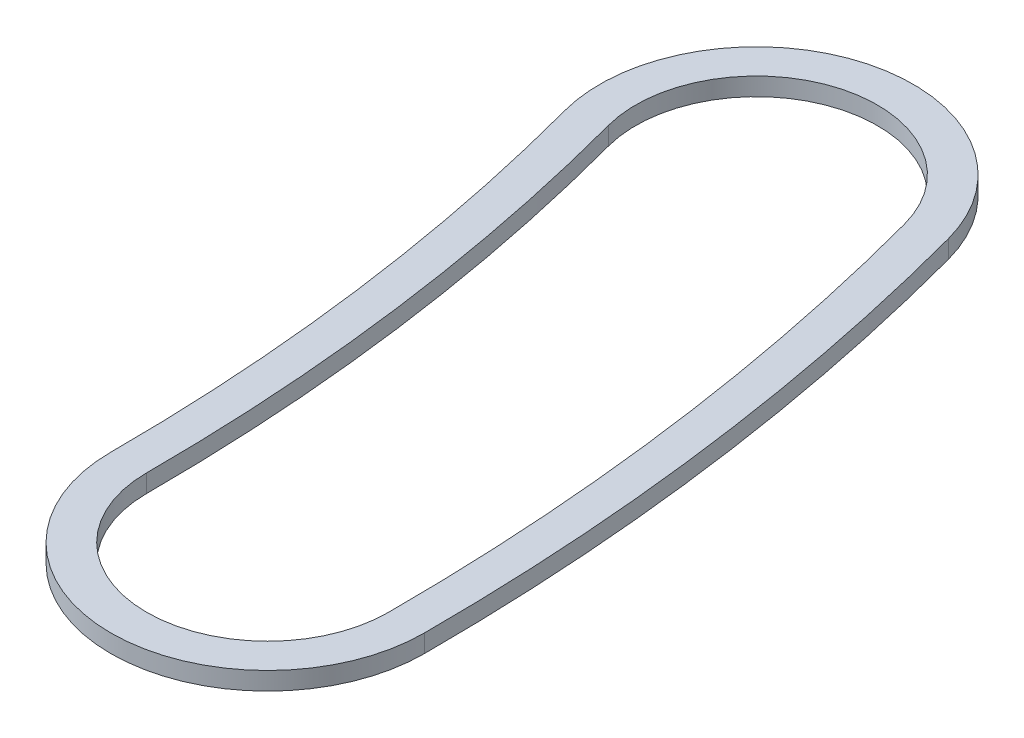
ISO-10303-21;
HEADER;
FILE_DESCRIPTION(('STEP AP214'),'2;1');
FILE_NAME('part.step','',(''),(''),'','','');
FILE_SCHEMA(('AUTOMOTIVE_DESIGN { 1 0 10303 214 1 1 1 1 }'));
ENDSEC;
DATA;
#1=APPLICATION_CONTEXT('core data for automotive mechanical design processes');
#2=APPLICATION_PROTOCOL_DEFINITION('international standard','automotive_design',2000,#1);
#3=PRODUCT_CONTEXT('',#1,'mechanical');
#4=PRODUCT('Part','Part','',(#3));
#5=PRODUCT_RELATED_PRODUCT_CATEGORY('part','',(#4));
#6=PRODUCT_DEFINITION_FORMATION('','',#4);
#7=PRODUCT_DEFINITION_CONTEXT('part definition',#1,'design');
#8=PRODUCT_DEFINITION('design','',#6,#7);
#9=PRODUCT_DEFINITION_SHAPE('','',#8);
#10=(LENGTH_UNIT() NAMED_UNIT(*) SI_UNIT(.MILLI.,.METRE.));
#11=(NAMED_UNIT(*) PLANE_ANGLE_UNIT() SI_UNIT($,.RADIAN.));
#12=(NAMED_UNIT(*) SI_UNIT($,.STERADIAN.) SOLID_ANGLE_UNIT());
#13=UNCERTAINTY_MEASURE_WITH_UNIT(LENGTH_MEASURE(1.E-05),#10,'distance_accuracy_value','');
#14=(GEOMETRIC_REPRESENTATION_CONTEXT(3) GLOBAL_UNCERTAINTY_ASSIGNED_CONTEXT((#13)) GLOBAL_UNIT_ASSIGNED_CONTEXT((#10,
#11,#12)) REPRESENTATION_CONTEXT('',''));
#15=CARTESIAN_POINT('',(0.,0.,0.));
#16=DIRECTION('',(0.,0.,1.));
#17=DIRECTION('',(1.,0.,0.));
#18=AXIS2_PLACEMENT_3D('',#15,#16,#17);
#19=CARTESIAN_POINT('',(30.861,0.508,0.));
#20=DIRECTION('',(0.,1.,0.));
#21=DIRECTION('',(0.,0.,1.));
#22=AXIS2_PLACEMENT_3D('',#19,#20,#21);
#23=PLANE('',#22);
#24=CARTESIAN_POINT('',(61.722,0.508,0.));
#25=DIRECTION('',(0.,1.,0.));
#26=DIRECTION('',(0.,0.,1.));
#27=AXIS2_PLACEMENT_3D('',#24,#25,#26);
#28=CIRCLE('',#27,4.445);
#29=CARTESIAN_POINT('',(57.277,0.508,0.));
#30=VERTEX_POINT('',#29);
#31=CARTESIAN_POINT('',(66.167,0.508,0.));
#32=VERTEX_POINT('',#31);
#33=EDGE_CURVE('E133',#30,#32,#28,.T.);
#34=ORIENTED_EDGE('',*,*,#33,.T.);
#35=CARTESIAN_POINT('',(0.,0.508,0.));
#36=DIRECTION('',(0.,1.,0.));
#37=DIRECTION('',(0.,0.,1.));
#38=AXIS2_PLACEMENT_3D('',#35,#36,#37);
#39=CIRCLE('',#38,66.167);
#40=CARTESIAN_POINT('',(63.9124141480686,0.508,-17.125279757299));
#41=VERTEX_POINT('',#40);
#42=EDGE_CURVE('E136',#32,#41,#39,.T.);
#43=ORIENTED_EDGE('',*,*,#42,.T.);
#44=CARTESIAN_POINT('',(59.6188738502138,0.508,-15.9748291018183));
#45=DIRECTION('',(0.,1.,0.));
#46=DIRECTION('',(0.,0.,1.));
#47=AXIS2_PLACEMENT_3D('',#44,#45,#46);
#48=CIRCLE('',#47,4.445);
#49=CARTESIAN_POINT('',(55.3253335523588,0.508,-14.8243784463375));
#50=VERTEX_POINT('',#49);
#51=EDGE_CURVE('E139',#41,#50,#48,.T.);
#52=ORIENTED_EDGE('',*,*,#51,.T.);
#53=CARTESIAN_POINT('',(0.,0.508,0.));
#54=DIRECTION('',(0.,-1.,0.));
#55=DIRECTION('',(0.,0.,1.));
#56=AXIS2_PLACEMENT_3D('',#53,#54,#55);
#57=CIRCLE('',#56,57.277);
#58=EDGE_CURVE('E141',#50,#30,#57,.T.);
#59=ORIENTED_EDGE('',*,*,#58,.T.);
#60=EDGE_LOOP('',(#34,#43,#52,#59));
#61=FACE_BOUND('',#60,.T.);
#62=CARTESIAN_POINT('',(0.,0.508,0.));
#63=DIRECTION('',(0.,1.,0.));
#64=DIRECTION('',(0.,0.,1.));
#65=AXIS2_PLACEMENT_3D('',#62,#63,#64);
#66=CIRCLE('',#65,65.151);
#67=CARTESIAN_POINT('',(65.151,0.508,0.));
#68=VERTEX_POINT('',#67);
#69=CARTESIAN_POINT('',(62.931033508559,0.508,-16.8623196074748));
#70=VERTEX_POINT('',#69);
#71=EDGE_CURVE('E105',#68,#70,#66,.T.);
#72=ORIENTED_EDGE('',*,*,#71,.F.);
#73=CARTESIAN_POINT('',(61.722,0.508,0.));
#74=DIRECTION('',(0.,1.,0.));
#75=DIRECTION('',(0.,0.,1.));
#76=AXIS2_PLACEMENT_3D('',#73,#74,#75);
#77=CIRCLE('',#76,3.429);
#78=CARTESIAN_POINT('',(58.293,0.508,0.));
#79=VERTEX_POINT('',#78);
#80=EDGE_CURVE('E97',#79,#68,#77,.T.);
#81=ORIENTED_EDGE('',*,*,#80,.F.);
#82=CARTESIAN_POINT('',(0.,0.508,0.));
#83=DIRECTION('',(0.,-1.,0.));
#84=DIRECTION('',(0.,0.,1.));
#85=AXIS2_PLACEMENT_3D('',#82,#83,#84);
#86=CIRCLE('',#85,58.293);
#87=CARTESIAN_POINT('',(56.3067141918685,0.508,-15.0873385961617));
#88=VERTEX_POINT('',#87);
#89=EDGE_CURVE('E119',#88,#79,#86,.T.);
#90=ORIENTED_EDGE('',*,*,#89,.F.);
#91=CARTESIAN_POINT('',(59.6188738502138,0.508,-15.9748291018183));
#92=DIRECTION('',(0.,1.,0.));
#93=DIRECTION('',(0.,0.,1.));
#94=AXIS2_PLACEMENT_3D('',#91,#92,#93);
#95=CIRCLE('',#94,3.429);
#96=EDGE_CURVE('E117',#70,#88,#95,.T.);
#97=ORIENTED_EDGE('',*,*,#96,.F.);
#98=EDGE_LOOP('',(#72,#81,#90,#97));
#99=FACE_BOUND('',#98,.T.);
#100=ADVANCED_FACE('F32',(#61,#99),#23,.T.);
#101=CARTESIAN_POINT('',(30.861,0.,0.));
#102=DIRECTION('',(0.,1.,0.));
#103=DIRECTION('',(0.,0.,1.));
#104=AXIS2_PLACEMENT_3D('',#101,#102,#103);
#105=PLANE('',#104);
#106=CARTESIAN_POINT('',(61.722,0.,0.));
#107=DIRECTION('',(0.,1.,0.));
#108=DIRECTION('',(0.,0.,1.));
#109=AXIS2_PLACEMENT_3D('',#106,#107,#108);
#110=CIRCLE('',#109,4.445);
#111=CARTESIAN_POINT('',(57.277,0.,0.));
#112=VERTEX_POINT('',#111);
#113=CARTESIAN_POINT('',(66.167,0.,0.));
#114=VERTEX_POINT('',#113);
#115=EDGE_CURVE('E113',#112,#114,#110,.T.);
#116=ORIENTED_EDGE('',*,*,#115,.F.);
#117=CARTESIAN_POINT('',(0.,0.,0.));
#118=DIRECTION('',(0.,-1.,0.));
#119=DIRECTION('',(0.,0.,1.));
#120=AXIS2_PLACEMENT_3D('',#117,#118,#119);
#121=CIRCLE('',#120,57.277);
#122=CARTESIAN_POINT('',(55.3253335523588,0.,-14.8243784463375));
#123=VERTEX_POINT('',#122);
#124=EDGE_CURVE('E137',#123,#112,#121,.T.);
#125=ORIENTED_EDGE('',*,*,#124,.F.);
#126=CARTESIAN_POINT('',(59.6188738502138,0.,-15.9748291018183));
#127=DIRECTION('',(0.,1.,0.));
#128=DIRECTION('',(0.,0.,1.));
#129=AXIS2_PLACEMENT_3D('',#126,#127,#128);
#130=CIRCLE('',#129,4.445);
#131=CARTESIAN_POINT('',(63.9124141480686,0.,-17.125279757299));
#132=VERTEX_POINT('',#131);
#133=EDGE_CURVE('E148',#132,#123,#130,.T.);
#134=ORIENTED_EDGE('',*,*,#133,.F.);
#135=CARTESIAN_POINT('',(0.,0.,0.));
#136=DIRECTION('',(0.,1.,0.));
#137=DIRECTION('',(0.,0.,1.));
#138=AXIS2_PLACEMENT_3D('',#135,#136,#137);
#139=CIRCLE('',#138,66.167);
#140=EDGE_CURVE('E146',#114,#132,#139,.T.);
#141=ORIENTED_EDGE('',*,*,#140,.F.);
#142=EDGE_LOOP('',(#116,#125,#134,#141));
#143=FACE_BOUND('',#142,.T.);
#144=CARTESIAN_POINT('',(61.722,0.,0.));
#145=DIRECTION('',(0.,1.,0.));
#146=DIRECTION('',(0.,0.,1.));
#147=AXIS2_PLACEMENT_3D('',#144,#145,#146);
#148=CIRCLE('',#147,3.429);
#149=CARTESIAN_POINT('',(58.293,0.,0.));
#150=VERTEX_POINT('',#149);
#151=CARTESIAN_POINT('',(65.151,0.,0.));
#152=VERTEX_POINT('',#151);
#153=EDGE_CURVE('E55',#150,#152,#148,.T.);
#154=ORIENTED_EDGE('',*,*,#153,.T.);
#155=CARTESIAN_POINT('',(0.,0.,0.));
#156=DIRECTION('',(0.,1.,0.));
#157=DIRECTION('',(0.,0.,1.));
#158=AXIS2_PLACEMENT_3D('',#155,#156,#157);
#159=CIRCLE('',#158,65.151);
#160=CARTESIAN_POINT('',(62.931033508559,0.,-16.8623196074748));
#161=VERTEX_POINT('',#160);
#162=EDGE_CURVE('E112',#152,#161,#159,.T.);
#163=ORIENTED_EDGE('',*,*,#162,.T.);
#164=CARTESIAN_POINT('',(59.6188738502138,0.,-15.9748291018183));
#165=DIRECTION('',(0.,1.,0.));
#166=DIRECTION('',(0.,0.,1.));
#167=AXIS2_PLACEMENT_3D('',#164,#165,#166);
#168=CIRCLE('',#167,3.429);
#169=CARTESIAN_POINT('',(56.3067141918685,0.,-15.0873385961617));
#170=VERTEX_POINT('',#169);
#171=EDGE_CURVE('E125',#161,#170,#168,.T.);
#172=ORIENTED_EDGE('',*,*,#171,.T.);
#173=CARTESIAN_POINT('',(0.,0.,0.));
#174=DIRECTION('',(0.,-1.,0.));
#175=DIRECTION('',(0.,0.,1.));
#176=AXIS2_PLACEMENT_3D('',#173,#174,#175);
#177=CIRCLE('',#176,58.293);
#178=EDGE_CURVE('E106',#170,#150,#177,.T.);
#179=ORIENTED_EDGE('',*,*,#178,.T.);
#180=EDGE_LOOP('',(#154,#163,#172,#179));
#181=FACE_BOUND('',#180,.T.);
#182=ADVANCED_FACE('F166',(#143,#181),#105,.F.);
#183=CARTESIAN_POINT('',(61.722,0.508,0.));
#184=DIRECTION('',(0.,-1.,0.));
#185=DIRECTION('',(0.,0.,-1.));
#186=AXIS2_PLACEMENT_3D('',#183,#184,#185);
#187=CYLINDRICAL_SURFACE('',#186,4.445);
#188=ORIENTED_EDGE('',*,*,#115,.T.);
#189=DIRECTION('',(0.,-1.,0.));
#190=VECTOR('',#189,1.);
#191=CARTESIAN_POINT('',(66.167,0.508,0.));
#192=LINE('',#191,#190);
#193=EDGE_CURVE('E11',#32,#114,#192,.T.);
#194=ORIENTED_EDGE('',*,*,#193,.F.);
#195=ORIENTED_EDGE('',*,*,#33,.F.);
#196=DIRECTION('',(0.,-1.,0.));
#197=VECTOR('',#196,1.);
#198=CARTESIAN_POINT('',(57.277,0.508,0.));
#199=LINE('',#198,#197);
#200=EDGE_CURVE('E143',#30,#112,#199,.T.);
#201=ORIENTED_EDGE('',*,*,#200,.T.);
#202=EDGE_LOOP('',(#188,#194,#195,#201));
#203=FACE_BOUND('',#202,.T.);
#204=ADVANCED_FACE('F34',(#203),#187,.T.);
#205=CARTESIAN_POINT('',(0.,0.508,0.));
#206=DIRECTION('',(0.,-1.,0.));
#207=DIRECTION('',(0.,0.,-1.));
#208=AXIS2_PLACEMENT_3D('',#205,#206,#207);
#209=CYLINDRICAL_SURFACE('',#208,66.167);
#210=ORIENTED_EDGE('',*,*,#140,.T.);
#211=DIRECTION('',(0.,-1.,0.));
#212=VECTOR('',#211,1.);
#213=CARTESIAN_POINT('',(63.9124141480686,0.508,-17.125279757299));
#214=LINE('',#213,#212);
#215=EDGE_CURVE('E40',#41,#132,#214,.T.);
#216=ORIENTED_EDGE('',*,*,#215,.F.);
#217=ORIENTED_EDGE('',*,*,#42,.F.);
#218=ORIENTED_EDGE('',*,*,#193,.T.);
#219=EDGE_LOOP('',(#210,#216,#217,#218));
#220=FACE_BOUND('',#219,.T.);
#221=ADVANCED_FACE('F176',(#220),#209,.T.);
#222=CARTESIAN_POINT('',(59.6188738502138,0.508,-15.9748291018183));
#223=DIRECTION('',(0.,-1.,0.));
#224=DIRECTION('',(0.,0.,-1.));
#225=AXIS2_PLACEMENT_3D('',#222,#223,#224);
#226=CYLINDRICAL_SURFACE('',#225,4.445);
#227=ORIENTED_EDGE('',*,*,#133,.T.);
#228=DIRECTION('',(0.,-1.,0.));
#229=VECTOR('',#228,1.);
#230=CARTESIAN_POINT('',(55.3253335523588,0.508,-14.8243784463375));
#231=LINE('',#230,#229);
#232=EDGE_CURVE('E153',#50,#123,#231,.T.);
#233=ORIENTED_EDGE('',*,*,#232,.F.);
#234=ORIENTED_EDGE('',*,*,#51,.F.);
#235=ORIENTED_EDGE('',*,*,#215,.T.);
#236=EDGE_LOOP('',(#227,#233,#234,#235));
#237=FACE_BOUND('',#236,.T.);
#238=ADVANCED_FACE('F160',(#237),#226,.T.);
#239=CARTESIAN_POINT('',(0.,0.508,0.));
#240=DIRECTION('',(0.,-1.,0.));
#241=DIRECTION('',(0.,0.,-1.));
#242=AXIS2_PLACEMENT_3D('',#239,#240,#241);
#243=CYLINDRICAL_SURFACE('',#242,57.277);
#244=ORIENTED_EDGE('',*,*,#124,.T.);
#245=ORIENTED_EDGE('',*,*,#200,.F.);
#246=ORIENTED_EDGE('',*,*,#58,.F.);
#247=ORIENTED_EDGE('',*,*,#232,.T.);
#248=EDGE_LOOP('',(#244,#245,#246,#247));
#249=FACE_BOUND('',#248,.T.);
#250=ADVANCED_FACE('F170',(#249),#243,.F.);
#251=CARTESIAN_POINT('',(61.722,0.508,0.));
#252=DIRECTION('',(0.,-1.,0.));
#253=DIRECTION('',(0.,0.,-1.));
#254=AXIS2_PLACEMENT_3D('',#251,#252,#253);
#255=CYLINDRICAL_SURFACE('',#254,3.429);
#256=ORIENTED_EDGE('',*,*,#153,.F.);
#257=DIRECTION('',(0.,-1.,0.));
#258=VECTOR('',#257,1.);
#259=CARTESIAN_POINT('',(58.293,0.508,0.));
#260=LINE('',#259,#258);
#261=EDGE_CURVE('E101',#79,#150,#260,.T.);
#262=ORIENTED_EDGE('',*,*,#261,.F.);
#263=ORIENTED_EDGE('',*,*,#80,.T.);
#264=DIRECTION('',(0.,-1.,0.));
#265=VECTOR('',#264,1.);
#266=CARTESIAN_POINT('',(65.151,0.508,0.));
#267=LINE('',#266,#265);
#268=EDGE_CURVE('E100',#68,#152,#267,.T.);
#269=ORIENTED_EDGE('',*,*,#268,.T.);
#270=EDGE_LOOP('',(#256,#262,#263,#269));
#271=FACE_BOUND('',#270,.T.);
#272=ADVANCED_FACE('F99',(#271),#255,.F.);
#273=CARTESIAN_POINT('',(0.,0.508,0.));
#274=DIRECTION('',(0.,-1.,0.));
#275=DIRECTION('',(0.,0.,-1.));
#276=AXIS2_PLACEMENT_3D('',#273,#274,#275);
#277=CYLINDRICAL_SURFACE('',#276,65.151);
#278=ORIENTED_EDGE('',*,*,#162,.F.);
#279=ORIENTED_EDGE('',*,*,#268,.F.);
#280=ORIENTED_EDGE('',*,*,#71,.T.);
#281=DIRECTION('',(0.,-1.,0.));
#282=VECTOR('',#281,1.);
#283=CARTESIAN_POINT('',(62.931033508559,0.508,-16.8623196074748));
#284=LINE('',#283,#282);
#285=EDGE_CURVE('E114',#70,#161,#284,.T.);
#286=ORIENTED_EDGE('',*,*,#285,.T.);
#287=EDGE_LOOP('',(#278,#279,#280,#286));
#288=FACE_BOUND('',#287,.T.);
#289=ADVANCED_FACE('F109',(#288),#277,.F.);
#290=CARTESIAN_POINT('',(59.6188738502138,0.508,-15.9748291018183));
#291=DIRECTION('',(0.,-1.,0.));
#292=DIRECTION('',(0.,0.,-1.));
#293=AXIS2_PLACEMENT_3D('',#290,#291,#292);
#294=CYLINDRICAL_SURFACE('',#293,3.429);
#295=ORIENTED_EDGE('',*,*,#171,.F.);
#296=ORIENTED_EDGE('',*,*,#285,.F.);
#297=ORIENTED_EDGE('',*,*,#96,.T.);
#298=DIRECTION('',(0.,-1.,0.));
#299=VECTOR('',#298,1.);
#300=CARTESIAN_POINT('',(56.3067141918685,0.508,-15.0873385961617));
#301=LINE('',#300,#299);
#302=EDGE_CURVE('E47',#88,#170,#301,.T.);
#303=ORIENTED_EDGE('',*,*,#302,.T.);
#304=EDGE_LOOP('',(#295,#296,#297,#303));
#305=FACE_BOUND('',#304,.T.);
#306=ADVANCED_FACE('F199',(#305),#294,.F.);
#307=CARTESIAN_POINT('',(0.,0.508,0.));
#308=DIRECTION('',(0.,-1.,0.));
#309=DIRECTION('',(0.,0.,-1.));
#310=AXIS2_PLACEMENT_3D('',#307,#308,#309);
#311=CYLINDRICAL_SURFACE('',#310,58.293);
#312=ORIENTED_EDGE('',*,*,#178,.F.);
#313=ORIENTED_EDGE('',*,*,#302,.F.);
#314=ORIENTED_EDGE('',*,*,#89,.T.);
#315=ORIENTED_EDGE('',*,*,#261,.T.);
#316=EDGE_LOOP('',(#312,#313,#314,#315));
#317=FACE_BOUND('',#316,.T.);
#318=ADVANCED_FACE('F203',(#317),#311,.T.);
#319=CLOSED_SHELL('',(#100,#182,#204,#221,#238,#250,#272,#289,#306,#318));
#320=MANIFOLD_SOLID_BREP('B2',#319);
#321=ADVANCED_BREP_SHAPE_REPRESENTATION('',(#18,#320),#14);
#322=SHAPE_DEFINITION_REPRESENTATION(#9,#321);
ENDSEC;
END-ISO-10303-21;
